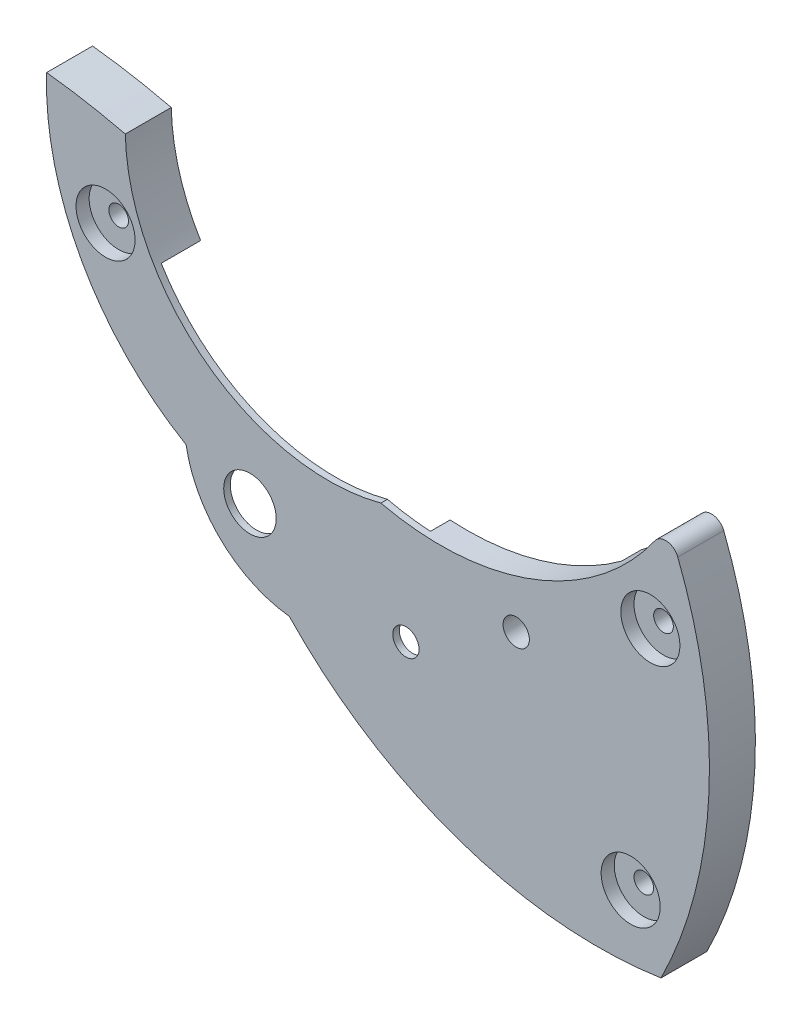
ISO-10303-21;
HEADER;
FILE_DESCRIPTION(('STEP AP214'),'2;1');
FILE_NAME('part.step','',(''),(''),'','','');
FILE_SCHEMA(('AUTOMOTIVE_DESIGN { 1 0 10303 214 1 1 1 1 }'));
ENDSEC;
DATA;
#1=APPLICATION_CONTEXT('core data for automotive mechanical design processes');
#2=APPLICATION_PROTOCOL_DEFINITION('international standard','automotive_design',2000,#1);
#3=PRODUCT_CONTEXT('',#1,'mechanical');
#4=PRODUCT('Part','Part','',(#3));
#5=PRODUCT_RELATED_PRODUCT_CATEGORY('part','',(#4));
#6=PRODUCT_DEFINITION_FORMATION('','',#4);
#7=PRODUCT_DEFINITION_CONTEXT('part definition',#1,'design');
#8=PRODUCT_DEFINITION('design','',#6,#7);
#9=PRODUCT_DEFINITION_SHAPE('','',#8);
#10=(LENGTH_UNIT() NAMED_UNIT(*) SI_UNIT(.MILLI.,.METRE.));
#11=(NAMED_UNIT(*) PLANE_ANGLE_UNIT() SI_UNIT($,.RADIAN.));
#12=(NAMED_UNIT(*) SI_UNIT($,.STERADIAN.) SOLID_ANGLE_UNIT());
#13=UNCERTAINTY_MEASURE_WITH_UNIT(LENGTH_MEASURE(1.E-05),#10,'distance_accuracy_value','');
#14=(GEOMETRIC_REPRESENTATION_CONTEXT(3) GLOBAL_UNCERTAINTY_ASSIGNED_CONTEXT((#13)) GLOBAL_UNIT_ASSIGNED_CONTEXT((#10,
#11,#12)) REPRESENTATION_CONTEXT('',''));
#15=CARTESIAN_POINT('',(0.,0.,0.));
#16=DIRECTION('',(0.,0.,1.));
#17=DIRECTION('',(1.,0.,0.));
#18=AXIS2_PLACEMENT_3D('',#15,#16,#17);
#19=CARTESIAN_POINT('',(5.125,11.125,0.));
#20=DIRECTION('',(0.,0.,1.));
#21=DIRECTION('',(1.,0.,0.));
#22=AXIS2_PLACEMENT_3D('',#19,#20,#21);
#23=PLANE('',#22);
#24=CARTESIAN_POINT('',(-5.5,6.5,0.));
#25=DIRECTION('',(0.,0.,1.));
#26=DIRECTION('',(1.,0.,0.));
#27=AXIS2_PLACEMENT_3D('',#24,#25,#26);
#28=CIRCLE('',#27,0.374999999999999);
#29=CARTESIAN_POINT('',(-5.125,6.5,0.));
#30=VERTEX_POINT('',#29);
#31=EDGE_CURVE('E424',#30,#30,#28,.T.);
#32=ORIENTED_EDGE('',*,*,#31,.T.);
#33=EDGE_LOOP('',(#32));
#34=FACE_BOUND('',#33,.T.);
#35=CARTESIAN_POINT('',(3.,10.,0.));
#36=DIRECTION('',(0.,0.,-1.));
#37=DIRECTION('',(1.,0.,0.));
#38=AXIS2_PLACEMENT_3D('',#35,#36,#37);
#39=CIRCLE('',#38,7.75);
#40=CARTESIAN_POINT('',(-3.62929963297461,5.98566488989238,0.));
#41=VERTEX_POINT('',#40);
#42=CARTESIAN_POINT('',(-4.74779558918888,9.81516626891871,0.));
#43=VERTEX_POINT('',#42);
#44=EDGE_CURVE('E134',#41,#43,#39,.T.);
#45=ORIENTED_EDGE('',*,*,#44,.F.);
#46=CARTESIAN_POINT('',(0.,0.,0.));
#47=DIRECTION('',(0.,0.,-1.));
#48=DIRECTION('',(-1.,0.,0.));
#49=AXIS2_PLACEMENT_3D('',#46,#47,#48);
#50=CIRCLE('',#49,7.);
#51=CARTESIAN_POINT('',(-5.83196120099189,3.8714633602974,0.));
#52=VERTEX_POINT('',#51);
#53=EDGE_CURVE('E296',#52,#41,#50,.T.);
#54=ORIENTED_EDGE('',*,*,#53,.F.);
#55=CARTESIAN_POINT('',(3.,10.,0.));
#56=DIRECTION('',(0.,0.,1.));
#57=DIRECTION('',(1.,0.,0.));
#58=AXIS2_PLACEMENT_3D('',#55,#56,#57);
#59=CIRCLE('',#58,10.7500000000002);
#60=CARTESIAN_POINT('',(-7.74447698150787,10.3445495520981,0.));
#61=VERTEX_POINT('',#60);
#62=EDGE_CURVE('E139',#61,#52,#59,.T.);
#63=ORIENTED_EDGE('',*,*,#62,.F.);
#64=CARTESIAN_POINT('',(-10.5,-14.,0.));
#65=DIRECTION('',(0.,0.,1.));
#66=DIRECTION('',(1.,0.,0.));
#67=AXIS2_PLACEMENT_3D('',#64,#65,#66);
#68=CIRCLE('',#67,24.5);
#69=EDGE_CURVE('E136',#43,#61,#68,.T.);
#70=ORIENTED_EDGE('',*,*,#69,.F.);
#71=EDGE_LOOP('',(#45,#54,#63,#70));
#72=FACE_BOUND('',#71,.T.);
#73=ADVANCED_FACE('F36',(#34,#72),#23,.F.);
#74=CARTESIAN_POINT('',(2.,1.5,1.75));
#75=DIRECTION('',(0.,0.,-1.));
#76=DIRECTION('',(-1.,0.,0.));
#77=AXIS2_PLACEMENT_3D('',#74,#75,#76);
#78=CYLINDRICAL_SURFACE('',#77,4.50000000000022);
#79=CARTESIAN_POINT('',(2.,1.5,1.5));
#80=DIRECTION('',(0.,0.,-1.));
#81=DIRECTION('',(-1.,0.,0.));
#82=AXIS2_PLACEMENT_3D('',#79,#80,#81);
#83=CIRCLE('',#82,4.50000000000022);
#84=CARTESIAN_POINT('',(1.49696633213116,-2.97179573873766,1.5));
#85=VERTEX_POINT('',#84);
#86=CARTESIAN_POINT('',(-2.43253058240849,0.723680068518556,1.5));
#87=VERTEX_POINT('',#86);
#88=EDGE_CURVE('E209',#85,#87,#83,.T.);
#89=ORIENTED_EDGE('',*,*,#88,.F.);
#90=DIRECTION('',(0.,0.,-1.));
#91=VECTOR('',#90,1.);
#92=CARTESIAN_POINT('',(1.49696633213116,-2.97179573873766,1.75));
#93=LINE('',#92,#91);
#94=CARTESIAN_POINT('',(1.49696633213116,-2.97179573873766,1.75));
#95=VERTEX_POINT('',#94);
#96=EDGE_CURVE('E154',#95,#85,#93,.T.);
#97=ORIENTED_EDGE('',*,*,#96,.F.);
#98=CARTESIAN_POINT('',(2.,1.5,1.75));
#99=DIRECTION('',(0.,0.,1.));
#100=DIRECTION('',(1.,0.,0.));
#101=AXIS2_PLACEMENT_3D('',#98,#99,#100);
#102=CIRCLE('',#101,4.50000000000022);
#103=CARTESIAN_POINT('',(-2.43253058240849,0.723680068518556,1.75));
#104=VERTEX_POINT('',#103);
#105=EDGE_CURVE('E199',#104,#95,#102,.T.);
#106=ORIENTED_EDGE('',*,*,#105,.F.);
#107=DIRECTION('',(0.,0.,-1.));
#108=VECTOR('',#107,1.);
#109=CARTESIAN_POINT('',(-2.43253058240849,0.723680068518556,1.75));
#110=LINE('',#109,#108);
#111=EDGE_CURVE('E157',#104,#87,#110,.T.);
#112=ORIENTED_EDGE('',*,*,#111,.T.);
#113=EDGE_LOOP('',(#89,#97,#106,#112));
#114=FACE_BOUND('',#113,.T.);
#115=ADVANCED_FACE('F206',(#114),#78,.T.);
#116=CARTESIAN_POINT('',(0.,0.,1.75));
#117=DIRECTION('',(0.,0.,-1.));
#118=DIRECTION('',(-1.,0.,0.));
#119=AXIS2_PLACEMENT_3D('',#116,#117,#118);
#120=CYLINDRICAL_SURFACE('',#119,0.99999999999998);
#121=CARTESIAN_POINT('',(0.,0.,1.75));
#122=DIRECTION('',(0.,0.,1.));
#123=DIRECTION('',(1.,0.,0.));
#124=AXIS2_PLACEMENT_3D('',#121,#122,#123);
#125=CIRCLE('',#124,0.99999999999998);
#126=CARTESIAN_POINT('',(0.99999999999998,0.,1.75));
#127=VERTEX_POINT('',#126);
#128=EDGE_CURVE('E137',#127,#127,#125,.T.);
#129=ORIENTED_EDGE('',*,*,#128,.T.);
#130=EDGE_LOOP('',(#129));
#131=FACE_BOUND('',#130,.T.);
#132=CARTESIAN_POINT('',(0.,0.,1.5));
#133=DIRECTION('',(0.,0.,-1.));
#134=DIRECTION('',(-1.,0.,0.));
#135=AXIS2_PLACEMENT_3D('',#132,#133,#134);
#136=CIRCLE('',#135,0.99999999999998);
#137=CARTESIAN_POINT('',(-0.99999999999998,0.,1.5));
#138=VERTEX_POINT('',#137);
#139=EDGE_CURVE('E284',#138,#138,#136,.T.);
#140=ORIENTED_EDGE('',*,*,#139,.T.);
#141=EDGE_LOOP('',(#140));
#142=FACE_BOUND('',#141,.T.);
#143=ADVANCED_FACE('F323',(#131,#142),#120,.F.);
#144=CARTESIAN_POINT('',(5.94044383167777,-1.59173712738051,1.75));
#145=DIRECTION('',(0.,0.,-1.));
#146=DIRECTION('',(-1.,0.,0.));
#147=AXIS2_PLACEMENT_3D('',#144,#145,#146);
#148=CYLINDRICAL_SURFACE('',#147,0.499999999999999);
#149=CARTESIAN_POINT('',(5.94044383167777,-1.59173712738051,1.75));
#150=DIRECTION('',(0.,0.,1.));
#151=DIRECTION('',(1.,0.,0.));
#152=AXIS2_PLACEMENT_3D('',#149,#150,#151);
#153=CIRCLE('',#152,0.499999999999999);
#154=CARTESIAN_POINT('',(6.44044383167777,-1.59173712738051,1.75));
#155=VERTEX_POINT('',#154);
#156=EDGE_CURVE('E190',#155,#155,#153,.T.);
#157=ORIENTED_EDGE('',*,*,#156,.T.);
#158=EDGE_LOOP('',(#157));
#159=FACE_BOUND('',#158,.T.);
#160=CARTESIAN_POINT('',(5.94044383167777,-1.59173712738051,1.5));
#161=DIRECTION('',(0.,0.,-1.));
#162=DIRECTION('',(-1.,0.,0.));
#163=AXIS2_PLACEMENT_3D('',#160,#161,#162);
#164=CIRCLE('',#163,0.499999999999999);
#165=CARTESIAN_POINT('',(5.44044383167777,-1.59173712738051,1.5));
#166=VERTEX_POINT('',#165);
#167=EDGE_CURVE('E40',#166,#166,#164,.T.);
#168=ORIENTED_EDGE('',*,*,#167,.T.);
#169=EDGE_LOOP('',(#168));
#170=FACE_BOUND('',#169,.T.);
#171=ADVANCED_FACE('F371',(#159,#170),#148,.F.);
#172=CARTESIAN_POINT('',(10.1406670400323,0.8332628726195,1.75));
#173=DIRECTION('',(0.,0.,-1.));
#174=DIRECTION('',(-1.,0.,0.));
#175=AXIS2_PLACEMENT_3D('',#172,#173,#174);
#176=CYLINDRICAL_SURFACE('',#175,0.499999999999999);
#177=CARTESIAN_POINT('',(10.1406670400323,0.8332628726195,1.75));
#178=DIRECTION('',(0.,0.,1.));
#179=DIRECTION('',(1.,0.,0.));
#180=AXIS2_PLACEMENT_3D('',#177,#178,#179);
#181=CIRCLE('',#180,0.499999999999999);
#182=CARTESIAN_POINT('',(10.6406670400323,0.8332628726195,1.75));
#183=VERTEX_POINT('',#182);
#184=EDGE_CURVE('E187',#183,#183,#181,.T.);
#185=ORIENTED_EDGE('',*,*,#184,.T.);
#186=EDGE_LOOP('',(#185));
#187=FACE_BOUND('',#186,.T.);
#188=CARTESIAN_POINT('',(10.1406670400323,0.8332628726195,0.75));
#189=DIRECTION('',(0.,0.,-1.));
#190=DIRECTION('',(-1.,0.,0.));
#191=AXIS2_PLACEMENT_3D('',#188,#189,#190);
#192=CIRCLE('',#191,0.499999999999999);
#193=CARTESIAN_POINT('',(9.64066704003229,0.8332628726195,0.75));
#194=VERTEX_POINT('',#193);
#195=EDGE_CURVE('E164',#194,#194,#192,.T.);
#196=ORIENTED_EDGE('',*,*,#195,.T.);
#197=EDGE_LOOP('',(#196));
#198=FACE_BOUND('',#197,.T.);
#199=ADVANCED_FACE('F336',(#187,#198),#176,.F.);
#200=CARTESIAN_POINT('',(5.125,11.125,1.75));
#201=DIRECTION('',(0.,0.,1.));
#202=DIRECTION('',(1.,0.,0.));
#203=AXIS2_PLACEMENT_3D('',#200,#201,#202);
#204=PLANE('',#203);
#205=CARTESIAN_POINT('',(14.5,-5.5,1.75));
#206=DIRECTION('',(0.,0.,1.));
#207=DIRECTION('',(1.,0.,0.));
#208=AXIS2_PLACEMENT_3D('',#205,#206,#207);
#209=CIRCLE('',#208,1.125);
#210=CARTESIAN_POINT('',(15.625,-5.5,1.75));
#211=VERTEX_POINT('',#210);
#212=EDGE_CURVE('E346',#211,#211,#209,.T.);
#213=ORIENTED_EDGE('',*,*,#212,.F.);
#214=EDGE_LOOP('',(#213));
#215=FACE_BOUND('',#214,.T.);
#216=CARTESIAN_POINT('',(15.25,3.5,1.75));
#217=DIRECTION('',(0.,0.,1.));
#218=DIRECTION('',(1.,0.,0.));
#219=AXIS2_PLACEMENT_3D('',#216,#217,#218);
#220=CIRCLE('',#219,1.125);
#221=CARTESIAN_POINT('',(16.375,3.5,1.75));
#222=VERTEX_POINT('',#221);
#223=EDGE_CURVE('E357',#222,#222,#220,.T.);
#224=ORIENTED_EDGE('',*,*,#223,.F.);
#225=EDGE_LOOP('',(#224));
#226=FACE_BOUND('',#225,.T.);
#227=CARTESIAN_POINT('',(-5.5,6.5,1.75));
#228=DIRECTION('',(0.,0.,1.));
#229=DIRECTION('',(1.,0.,0.));
#230=AXIS2_PLACEMENT_3D('',#227,#228,#229);
#231=CIRCLE('',#230,1.125);
#232=CARTESIAN_POINT('',(-4.375,6.5,1.75));
#233=VERTEX_POINT('',#232);
#234=EDGE_CURVE('E300',#233,#233,#231,.T.);
#235=ORIENTED_EDGE('',*,*,#234,.F.);
#236=EDGE_LOOP('',(#235));
#237=FACE_BOUND('',#236,.T.);
#238=ORIENTED_EDGE('',*,*,#156,.F.);
#239=EDGE_LOOP('',(#238));
#240=FACE_BOUND('',#239,.T.);
#241=CARTESIAN_POINT('',(3.,10.,1.75));
#242=DIRECTION('',(0.,0.,-1.));
#243=DIRECTION('',(1.,0.,0.));
#244=AXIS2_PLACEMENT_3D('',#241,#242,#243);
#245=CIRCLE('',#244,7.75);
#246=CARTESIAN_POINT('',(4.98775044540647,2.50924915867666,1.75));
#247=VERTEX_POINT('',#246);
#248=CARTESIAN_POINT('',(-4.74779558918888,9.81516626891871,1.75));
#249=VERTEX_POINT('',#248);
#250=EDGE_CURVE('E149',#247,#249,#245,.T.);
#251=ORIENTED_EDGE('',*,*,#250,.T.);
#252=CARTESIAN_POINT('',(-10.5,-14.,1.75));
#253=DIRECTION('',(0.,0.,1.));
#254=DIRECTION('',(1.,0.,0.));
#255=AXIS2_PLACEMENT_3D('',#252,#253,#254);
#256=CIRCLE('',#255,24.5);
#257=CARTESIAN_POINT('',(-7.74447698150787,10.3445495520981,1.75));
#258=VERTEX_POINT('',#257);
#259=EDGE_CURVE('E94',#249,#258,#256,.T.);
#260=ORIENTED_EDGE('',*,*,#259,.T.);
#261=CARTESIAN_POINT('',(3.,10.,1.75));
#262=DIRECTION('',(0.,0.,1.));
#263=DIRECTION('',(1.,0.,0.));
#264=AXIS2_PLACEMENT_3D('',#261,#262,#263);
#265=CIRCLE('',#264,10.7500000000002);
#266=EDGE_CURVE('E197',#258,#104,#265,.T.);
#267=ORIENTED_EDGE('',*,*,#266,.T.);
#268=ORIENTED_EDGE('',*,*,#105,.T.);
#269=CARTESIAN_POINT('',(13.25,8.25,1.75));
#270=DIRECTION('',(0.,0.,1.));
#271=DIRECTION('',(1.,0.,0.));
#272=AXIS2_PLACEMENT_3D('',#269,#270,#271);
#273=CIRCLE('',#272,16.2500000000003);
#274=CARTESIAN_POINT('',(15.6550771901216,-7.82103306292306,1.75));
#275=VERTEX_POINT('',#274);
#276=EDGE_CURVE('E116',#95,#275,#273,.T.);
#277=ORIENTED_EDGE('',*,*,#276,.T.);
#278=CARTESIAN_POINT('',(0.,0.,1.75));
#279=DIRECTION('',(0.,0.,1.));
#280=DIRECTION('',(1.,0.,0.));
#281=AXIS2_PLACEMENT_3D('',#278,#279,#280);
#282=CIRCLE('',#281,17.5);
#283=CARTESIAN_POINT('',(16.2956500802893,6.37979533063312,1.75));
#284=VERTEX_POINT('',#283);
#285=EDGE_CURVE('E109',#275,#284,#282,.T.);
#286=ORIENTED_EDGE('',*,*,#285,.T.);
#287=CARTESIAN_POINT('',(15.8300600779953,6.1975154640436,1.75));
#288=DIRECTION('',(0.,0.,1.));
#289=DIRECTION('',(1.,0.,0.));
#290=AXIS2_PLACEMENT_3D('',#287,#288,#289);
#291=CIRCLE('',#290,0.5);
#292=CARTESIAN_POINT('',(15.4214857885669,6.48572901337485,1.75));
#293=VERTEX_POINT('',#292);
#294=EDGE_CURVE('E114',#284,#293,#291,.T.);
#295=ORIENTED_EDGE('',*,*,#294,.T.);
#296=CARTESIAN_POINT('',(7.25,12.25,1.75));
#297=DIRECTION('',(0.,0.,-1.));
#298=DIRECTION('',(1.,0.,0.));
#299=AXIS2_PLACEMENT_3D('',#296,#297,#298);
#300=CIRCLE('',#299,10.);
#301=EDGE_CURVE('E60',#293,#247,#300,.T.);
#302=ORIENTED_EDGE('',*,*,#301,.T.);
#303=EDGE_LOOP('',(#251,#260,#267,#268,#277,#286,#295,#302));
#304=FACE_BOUND('',#303,.T.);
#305=ORIENTED_EDGE('',*,*,#128,.F.);
#306=EDGE_LOOP('',(#305));
#307=FACE_BOUND('',#306,.T.);
#308=ORIENTED_EDGE('',*,*,#184,.F.);
#309=EDGE_LOOP('',(#308));
#310=FACE_BOUND('',#309,.T.);
#311=ADVANCED_FACE('F111',(#215,#226,#237,#240,#304,#307,#310),#204,.T.);
#312=CARTESIAN_POINT('',(14.5,-5.5,0.));
#313=DIRECTION('',(0.,0.,1.));
#314=DIRECTION('',(1.,0.,0.));
#315=AXIS2_PLACEMENT_3D('',#312,#313,#314);
#316=CIRCLE('',#315,0.375);
#317=CARTESIAN_POINT('',(14.875,-5.5,0.));
#318=VERTEX_POINT('',#317);
#319=EDGE_CURVE('E341',#318,#318,#316,.T.);
#320=ORIENTED_EDGE('',*,*,#319,.T.);
#321=EDGE_LOOP('',(#320));
#322=FACE_BOUND('',#321,.T.);
#323=CARTESIAN_POINT('',(15.25,3.5,0.));
#324=DIRECTION('',(0.,0.,1.));
#325=DIRECTION('',(1.,0.,0.));
#326=AXIS2_PLACEMENT_3D('',#323,#324,#325);
#327=CIRCLE('',#326,0.375);
#328=CARTESIAN_POINT('',(15.625,3.5,0.));
#329=VERTEX_POINT('',#328);
#330=EDGE_CURVE('E344',#329,#329,#327,.T.);
#331=ORIENTED_EDGE('',*,*,#330,.T.);
#332=EDGE_LOOP('',(#331));
#333=FACE_BOUND('',#332,.T.);
#334=CARTESIAN_POINT('',(13.25,8.25,0.));
#335=DIRECTION('',(0.,0.,1.));
#336=DIRECTION('',(1.,0.,0.));
#337=AXIS2_PLACEMENT_3D('',#334,#335,#336);
#338=CIRCLE('',#337,16.2500000000003);
#339=CARTESIAN_POINT('',(4.44487898154678,-5.40768442490903,0.));
#340=VERTEX_POINT('',#339);
#341=CARTESIAN_POINT('',(15.6550771901216,-7.82103306292306,0.));
#342=VERTEX_POINT('',#341);
#343=EDGE_CURVE('E142',#340,#342,#338,.T.);
#344=ORIENTED_EDGE('',*,*,#343,.F.);
#345=CARTESIAN_POINT('',(6.69110879720328,-2.05646859056707,0.));
#346=VERTEX_POINT('',#345);
#347=EDGE_CURVE('E294',#346,#340,#50,.T.);
#348=ORIENTED_EDGE('',*,*,#347,.F.);
#349=CARTESIAN_POINT('',(10.1406670400323,0.8332628726195,0.));
#350=DIRECTION('',(0.,0.,-1.));
#351=DIRECTION('',(-1.,0.,0.));
#352=AXIS2_PLACEMENT_3D('',#349,#350,#351);
#353=CIRCLE('',#352,4.5);
#354=CARTESIAN_POINT('',(13.1518555762726,4.17732381692288,0.));
#355=VERTEX_POINT('',#354);
#356=EDGE_CURVE('E174',#355,#346,#353,.T.);
#357=ORIENTED_EDGE('',*,*,#356,.F.);
#358=CARTESIAN_POINT('',(7.25,12.25,0.));
#359=DIRECTION('',(0.,0.,-1.));
#360=DIRECTION('',(1.,0.,0.));
#361=AXIS2_PLACEMENT_3D('',#358,#359,#360);
#362=CIRCLE('',#361,10.);
#363=CARTESIAN_POINT('',(15.4214857885669,6.48572901337485,0.));
#364=VERTEX_POINT('',#363);
#365=EDGE_CURVE('E146',#364,#355,#362,.T.);
#366=ORIENTED_EDGE('',*,*,#365,.F.);
#367=CARTESIAN_POINT('',(15.8300600779953,6.1975154640436,0.));
#368=DIRECTION('',(0.,0.,1.));
#369=DIRECTION('',(1.,0.,0.));
#370=AXIS2_PLACEMENT_3D('',#367,#368,#369);
#371=CIRCLE('',#370,0.5);
#372=CARTESIAN_POINT('',(16.2956500802893,6.37979533063312,0.));
#373=VERTEX_POINT('',#372);
#374=EDGE_CURVE('E85',#373,#364,#371,.T.);
#375=ORIENTED_EDGE('',*,*,#374,.F.);
#376=CARTESIAN_POINT('',(0.,0.,0.));
#377=DIRECTION('',(0.,0.,1.));
#378=DIRECTION('',(1.,0.,0.));
#379=AXIS2_PLACEMENT_3D('',#376,#377,#378);
#380=CIRCLE('',#379,17.5);
#381=EDGE_CURVE('E124',#342,#373,#380,.T.);
#382=ORIENTED_EDGE('',*,*,#381,.F.);
#383=EDGE_LOOP('',(#344,#348,#357,#366,#375,#382));
#384=FACE_BOUND('',#383,.T.);
#385=ADVANCED_FACE('F216',(#322,#333,#384),#23,.F.);
#386=CARTESIAN_POINT('',(3.,10.,1.75));
#387=DIRECTION('',(0.,0.,-1.));
#388=DIRECTION('',(-1.,0.,0.));
#389=AXIS2_PLACEMENT_3D('',#386,#387,#388);
#390=CYLINDRICAL_SURFACE('',#389,7.75);
#391=CARTESIAN_POINT('',(3.,10.,1.5));
#392=DIRECTION('',(0.,0.,-1.));
#393=DIRECTION('',(-1.,0.,0.));
#394=AXIS2_PLACEMENT_3D('',#391,#392,#393);
#395=CIRCLE('',#394,7.75);
#396=CARTESIAN_POINT('',(-3.62929963297461,5.98566488989238,1.5));
#397=VERTEX_POINT('',#396);
#398=CARTESIAN_POINT('',(4.98775044540647,2.50924915867666,1.5));
#399=VERTEX_POINT('',#398);
#400=EDGE_CURVE('E289',#397,#399,#395,.F.);
#401=ORIENTED_EDGE('',*,*,#400,.F.);
#402=DIRECTION('',(0.,0.,-1.));
#403=VECTOR('',#402,1.);
#404=CARTESIAN_POINT('',(-3.62929963297461,5.98566488989238,0.75));
#405=LINE('',#404,#403);
#406=EDGE_CURVE('E272',#397,#41,#405,.T.);
#407=ORIENTED_EDGE('',*,*,#406,.T.);
#408=ORIENTED_EDGE('',*,*,#44,.T.);
#409=DIRECTION('',(0.,0.,-1.));
#410=VECTOR('',#409,1.);
#411=CARTESIAN_POINT('',(-4.74779558918888,9.81516626891871,1.75));
#412=LINE('',#411,#410);
#413=EDGE_CURVE('E45',#249,#43,#412,.T.);
#414=ORIENTED_EDGE('',*,*,#413,.F.);
#415=ORIENTED_EDGE('',*,*,#250,.F.);
#416=DIRECTION('',(0.,0.,-1.));
#417=VECTOR('',#416,1.);
#418=CARTESIAN_POINT('',(4.98775044540647,2.50924915867666,1.75));
#419=LINE('',#418,#417);
#420=EDGE_CURVE('E130',#247,#399,#419,.T.);
#421=ORIENTED_EDGE('',*,*,#420,.T.);
#422=EDGE_LOOP('',(#401,#407,#408,#414,#415,#421));
#423=FACE_BOUND('',#422,.T.);
#424=ADVANCED_FACE('F38',(#423),#390,.F.);
#425=CARTESIAN_POINT('',(-10.5,-14.,1.75));
#426=DIRECTION('',(0.,0.,-1.));
#427=DIRECTION('',(-1.,0.,0.));
#428=AXIS2_PLACEMENT_3D('',#425,#426,#427);
#429=CYLINDRICAL_SURFACE('',#428,24.5);
#430=ORIENTED_EDGE('',*,*,#69,.T.);
#431=DIRECTION('',(0.,0.,-1.));
#432=VECTOR('',#431,1.);
#433=CARTESIAN_POINT('',(-7.74447698150787,10.3445495520981,1.75));
#434=LINE('',#433,#432);
#435=EDGE_CURVE('E160',#258,#61,#434,.T.);
#436=ORIENTED_EDGE('',*,*,#435,.F.);
#437=ORIENTED_EDGE('',*,*,#259,.F.);
#438=ORIENTED_EDGE('',*,*,#413,.T.);
#439=EDGE_LOOP('',(#430,#436,#437,#438));
#440=FACE_BOUND('',#439,.T.);
#441=ADVANCED_FACE('F334',(#440),#429,.T.);
#442=CARTESIAN_POINT('',(3.,10.,1.75));
#443=DIRECTION('',(0.,0.,-1.));
#444=DIRECTION('',(-1.,0.,0.));
#445=AXIS2_PLACEMENT_3D('',#442,#443,#444);
#446=CYLINDRICAL_SURFACE('',#445,10.7500000000002);
#447=ORIENTED_EDGE('',*,*,#62,.T.);
#448=DIRECTION('',(0.,0.,-1.));
#449=VECTOR('',#448,1.);
#450=CARTESIAN_POINT('',(-5.83196120099189,3.8714633602974,0.75));
#451=LINE('',#450,#449);
#452=CARTESIAN_POINT('',(-5.83196120099189,3.8714633602974,1.5));
#453=VERTEX_POINT('',#452);
#454=EDGE_CURVE('E269',#52,#453,#451,.F.);
#455=ORIENTED_EDGE('',*,*,#454,.T.);
#456=CARTESIAN_POINT('',(3.,10.,1.5));
#457=DIRECTION('',(0.,0.,-1.));
#458=DIRECTION('',(-1.,0.,0.));
#459=AXIS2_PLACEMENT_3D('',#456,#457,#458);
#460=CIRCLE('',#459,10.7500000000002);
#461=EDGE_CURVE('E180',#87,#453,#460,.T.);
#462=ORIENTED_EDGE('',*,*,#461,.F.);
#463=ORIENTED_EDGE('',*,*,#111,.F.);
#464=ORIENTED_EDGE('',*,*,#266,.F.);
#465=ORIENTED_EDGE('',*,*,#435,.T.);
#466=EDGE_LOOP('',(#447,#455,#462,#463,#464,#465));
#467=FACE_BOUND('',#466,.T.);
#468=ADVANCED_FACE('F276',(#467),#446,.T.);
#469=CARTESIAN_POINT('',(13.25,8.25,1.75));
#470=DIRECTION('',(0.,0.,-1.));
#471=DIRECTION('',(-1.,0.,0.));
#472=AXIS2_PLACEMENT_3D('',#469,#470,#471);
#473=CYLINDRICAL_SURFACE('',#472,16.2500000000003);
#474=CARTESIAN_POINT('',(13.25,8.25,1.5));
#475=DIRECTION('',(0.,0.,-1.));
#476=DIRECTION('',(-1.,0.,0.));
#477=AXIS2_PLACEMENT_3D('',#474,#475,#476);
#478=CIRCLE('',#477,16.2500000000003);
#479=CARTESIAN_POINT('',(4.44487898154678,-5.40768442490903,1.5));
#480=VERTEX_POINT('',#479);
#481=EDGE_CURVE('E291',#480,#85,#478,.T.);
#482=ORIENTED_EDGE('',*,*,#481,.F.);
#483=DIRECTION('',(0.,0.,-1.));
#484=VECTOR('',#483,1.);
#485=CARTESIAN_POINT('',(4.44487898154678,-5.40768442490903,0.75));
#486=LINE('',#485,#484);
#487=EDGE_CURVE('E278',#480,#340,#486,.T.);
#488=ORIENTED_EDGE('',*,*,#487,.T.);
#489=ORIENTED_EDGE('',*,*,#343,.T.);
#490=DIRECTION('',(0.,0.,-1.));
#491=VECTOR('',#490,1.);
#492=CARTESIAN_POINT('',(15.6550771901216,-7.82103306292306,1.75));
#493=LINE('',#492,#491);
#494=EDGE_CURVE('E125',#275,#342,#493,.T.);
#495=ORIENTED_EDGE('',*,*,#494,.F.);
#496=ORIENTED_EDGE('',*,*,#276,.F.);
#497=ORIENTED_EDGE('',*,*,#96,.T.);
#498=EDGE_LOOP('',(#482,#488,#489,#495,#496,#497));
#499=FACE_BOUND('',#498,.T.);
#500=ADVANCED_FACE('F212',(#499),#473,.T.);
#501=CARTESIAN_POINT('',(0.,0.,1.75));
#502=DIRECTION('',(0.,0.,-1.));
#503=DIRECTION('',(-1.,0.,0.));
#504=AXIS2_PLACEMENT_3D('',#501,#502,#503);
#505=CYLINDRICAL_SURFACE('',#504,17.5);
#506=ORIENTED_EDGE('',*,*,#381,.T.);
#507=DIRECTION('',(0.,0.,-1.));
#508=VECTOR('',#507,1.);
#509=CARTESIAN_POINT('',(16.2956500802893,6.37979533063312,1.75));
#510=LINE('',#509,#508);
#511=EDGE_CURVE('E121',#284,#373,#510,.T.);
#512=ORIENTED_EDGE('',*,*,#511,.F.);
#513=ORIENTED_EDGE('',*,*,#285,.F.);
#514=ORIENTED_EDGE('',*,*,#494,.T.);
#515=EDGE_LOOP('',(#506,#512,#513,#514));
#516=FACE_BOUND('',#515,.T.);
#517=ADVANCED_FACE('F122',(#516),#505,.T.);
#518=CARTESIAN_POINT('',(15.8300600779953,6.1975154640436,1.75));
#519=DIRECTION('',(0.,0.,-1.));
#520=DIRECTION('',(-1.,0.,0.));
#521=AXIS2_PLACEMENT_3D('',#518,#519,#520);
#522=CYLINDRICAL_SURFACE('',#521,0.5);
#523=ORIENTED_EDGE('',*,*,#374,.T.);
#524=DIRECTION('',(0.,0.,-1.));
#525=VECTOR('',#524,1.);
#526=CARTESIAN_POINT('',(15.4214857885669,6.48572901337485,1.75));
#527=LINE('',#526,#525);
#528=EDGE_CURVE('E126',#293,#364,#527,.T.);
#529=ORIENTED_EDGE('',*,*,#528,.F.);
#530=ORIENTED_EDGE('',*,*,#294,.F.);
#531=ORIENTED_EDGE('',*,*,#511,.T.);
#532=EDGE_LOOP('',(#523,#529,#530,#531));
#533=FACE_BOUND('',#532,.T.);
#534=ADVANCED_FACE('F128',(#533),#522,.T.);
#535=CARTESIAN_POINT('',(7.25,12.25,1.75));
#536=DIRECTION('',(0.,0.,-1.));
#537=DIRECTION('',(-1.,0.,0.));
#538=AXIS2_PLACEMENT_3D('',#535,#536,#537);
#539=CYLINDRICAL_SURFACE('',#538,10.);
#540=CARTESIAN_POINT('',(7.25,12.25,0.75));
#541=DIRECTION('',(0.,0.,-1.));
#542=DIRECTION('',(-1.,0.,0.));
#543=AXIS2_PLACEMENT_3D('',#540,#541,#542);
#544=CIRCLE('',#543,10.);
#545=CARTESIAN_POINT('',(6.6217995325694,2.26975129705076,0.75));
#546=VERTEX_POINT('',#545);
#547=CARTESIAN_POINT('',(13.1518555762726,4.17732381692288,0.75));
#548=VERTEX_POINT('',#547);
#549=EDGE_CURVE('E166',#546,#548,#544,.F.);
#550=ORIENTED_EDGE('',*,*,#549,.F.);
#551=DIRECTION('',(0.,0.,-1.));
#552=VECTOR('',#551,1.);
#553=CARTESIAN_POINT('',(6.6217995325694,2.26975129705076,0.75));
#554=LINE('',#553,#552);
#555=CARTESIAN_POINT('',(6.6217995325694,2.26975129705076,1.5));
#556=VERTEX_POINT('',#555);
#557=EDGE_CURVE('E51',#546,#556,#554,.F.);
#558=ORIENTED_EDGE('',*,*,#557,.T.);
#559=CARTESIAN_POINT('',(7.25,12.25,1.5));
#560=DIRECTION('',(0.,0.,-1.));
#561=DIRECTION('',(-1.,0.,0.));
#562=AXIS2_PLACEMENT_3D('',#559,#560,#561);
#563=CIRCLE('',#562,10.);
#564=EDGE_CURVE('E287',#399,#556,#563,.F.);
#565=ORIENTED_EDGE('',*,*,#564,.F.);
#566=ORIENTED_EDGE('',*,*,#420,.F.);
#567=ORIENTED_EDGE('',*,*,#301,.F.);
#568=ORIENTED_EDGE('',*,*,#528,.T.);
#569=ORIENTED_EDGE('',*,*,#365,.T.);
#570=DIRECTION('',(0.,0.,-1.));
#571=VECTOR('',#570,1.);
#572=CARTESIAN_POINT('',(13.1518555762726,4.17732381692288,0.375));
#573=LINE('',#572,#571);
#574=EDGE_CURVE('E171',#355,#548,#573,.F.);
#575=ORIENTED_EDGE('',*,*,#574,.T.);
#576=EDGE_LOOP('',(#550,#558,#565,#566,#567,#568,#569,#575));
#577=FACE_BOUND('',#576,.T.);
#578=ADVANCED_FACE('F224',(#577),#539,.F.);
#579=CARTESIAN_POINT('',(10.1406670400323,0.8332628726195,0.75));
#580=DIRECTION('',(0.,0.,-1.));
#581=DIRECTION('',(-1.,0.,0.));
#582=AXIS2_PLACEMENT_3D('',#579,#580,#581);
#583=CYLINDRICAL_SURFACE('',#582,4.5);
#584=ORIENTED_EDGE('',*,*,#356,.T.);
#585=DIRECTION('',(0.,0.,-1.));
#586=VECTOR('',#585,1.);
#587=CARTESIAN_POINT('',(6.69110879720328,-2.05646859056707,0.75));
#588=LINE('',#587,#586);
#589=CARTESIAN_POINT('',(6.69110879720328,-2.05646859056707,0.75));
#590=VERTEX_POINT('',#589);
#591=EDGE_CURVE('E273',#346,#590,#588,.F.);
#592=ORIENTED_EDGE('',*,*,#591,.T.);
#593=CARTESIAN_POINT('',(10.1406670400323,0.8332628726195,0.75));
#594=DIRECTION('',(0.,0.,-1.));
#595=DIRECTION('',(-1.,0.,0.));
#596=AXIS2_PLACEMENT_3D('',#593,#594,#595);
#597=CIRCLE('',#596,4.5);
#598=EDGE_CURVE('E167',#548,#590,#597,.T.);
#599=ORIENTED_EDGE('',*,*,#598,.F.);
#600=ORIENTED_EDGE('',*,*,#574,.F.);
#601=EDGE_LOOP('',(#584,#592,#599,#600));
#602=FACE_BOUND('',#601,.T.);
#603=ADVANCED_FACE('F307',(#602),#583,.F.);
#604=CARTESIAN_POINT('',(10.1406670400323,0.8332628726195,0.75));
#605=DIRECTION('',(0.,0.,-1.));
#606=DIRECTION('',(-1.,0.,0.));
#607=AXIS2_PLACEMENT_3D('',#604,#605,#606);
#608=PLANE('',#607);
#609=CARTESIAN_POINT('',(0.,0.,0.75));
#610=DIRECTION('',(0.,0.,-1.));
#611=DIRECTION('',(-1.,0.,0.));
#612=AXIS2_PLACEMENT_3D('',#609,#610,#611);
#613=CIRCLE('',#612,7.);
#614=EDGE_CURVE('E11',#546,#590,#613,.T.);
#615=ORIENTED_EDGE('',*,*,#614,.F.);
#616=ORIENTED_EDGE('',*,*,#549,.T.);
#617=ORIENTED_EDGE('',*,*,#598,.T.);
#618=EDGE_LOOP('',(#615,#616,#617));
#619=FACE_BOUND('',#618,.T.);
#620=ORIENTED_EDGE('',*,*,#195,.F.);
#621=EDGE_LOOP('',(#620));
#622=FACE_BOUND('',#621,.T.);
#623=ADVANCED_FACE('F305',(#619,#622),#608,.T.);
#624=CARTESIAN_POINT('',(0.,0.,1.5));
#625=DIRECTION('',(0.,0.,-1.));
#626=DIRECTION('',(-1.,0.,0.));
#627=AXIS2_PLACEMENT_3D('',#624,#625,#626);
#628=PLANE('',#627);
#629=ORIENTED_EDGE('',*,*,#139,.F.);
#630=EDGE_LOOP('',(#629));
#631=FACE_BOUND('',#630,.T.);
#632=ORIENTED_EDGE('',*,*,#167,.F.);
#633=EDGE_LOOP('',(#632));
#634=FACE_BOUND('',#633,.T.);
#635=ORIENTED_EDGE('',*,*,#461,.T.);
#636=CARTESIAN_POINT('',(0.,0.,1.5));
#637=DIRECTION('',(0.,0.,-1.));
#638=DIRECTION('',(-1.,0.,0.));
#639=AXIS2_PLACEMENT_3D('',#636,#637,#638);
#640=CIRCLE('',#639,7.);
#641=EDGE_CURVE('E263',#453,#397,#640,.T.);
#642=ORIENTED_EDGE('',*,*,#641,.T.);
#643=ORIENTED_EDGE('',*,*,#400,.T.);
#644=ORIENTED_EDGE('',*,*,#564,.T.);
#645=EDGE_CURVE('E274',#556,#480,#640,.T.);
#646=ORIENTED_EDGE('',*,*,#645,.T.);
#647=ORIENTED_EDGE('',*,*,#481,.T.);
#648=ORIENTED_EDGE('',*,*,#88,.T.);
#649=EDGE_LOOP('',(#635,#642,#643,#644,#646,#647,#648));
#650=FACE_BOUND('',#649,.T.);
#651=ADVANCED_FACE('F262',(#631,#634,#650),#628,.T.);
#652=CARTESIAN_POINT('',(0.,0.,1.5));
#653=DIRECTION('',(0.,0.,-1.));
#654=DIRECTION('',(-1.,0.,0.));
#655=AXIS2_PLACEMENT_3D('',#652,#653,#654);
#656=CYLINDRICAL_SURFACE('',#655,7.);
#657=ORIENTED_EDGE('',*,*,#641,.F.);
#658=ORIENTED_EDGE('',*,*,#454,.F.);
#659=ORIENTED_EDGE('',*,*,#53,.T.);
#660=ORIENTED_EDGE('',*,*,#406,.F.);
#661=EDGE_LOOP('',(#657,#658,#659,#660));
#662=FACE_BOUND('',#661,.T.);
#663=ADVANCED_FACE('F268',(#662),#656,.F.);
#664=ORIENTED_EDGE('',*,*,#645,.F.);
#665=ORIENTED_EDGE('',*,*,#557,.F.);
#666=ORIENTED_EDGE('',*,*,#614,.T.);
#667=ORIENTED_EDGE('',*,*,#591,.F.);
#668=ORIENTED_EDGE('',*,*,#347,.T.);
#669=ORIENTED_EDGE('',*,*,#487,.F.);
#670=EDGE_LOOP('',(#664,#665,#666,#667,#668,#669));
#671=FACE_BOUND('',#670,.T.);
#672=ADVANCED_FACE('F293',(#671),#656,.F.);
#673=CARTESIAN_POINT('',(-5.5,6.5,1.25));
#674=DIRECTION('',(0.,0.,1.));
#675=DIRECTION('',(1.,0.,0.));
#676=AXIS2_PLACEMENT_3D('',#673,#674,#675);
#677=CYLINDRICAL_SURFACE('',#676,1.125);
#678=CARTESIAN_POINT('',(-5.5,6.5,1.25));
#679=DIRECTION('',(0.,0.,1.));
#680=DIRECTION('',(1.,0.,0.));
#681=AXIS2_PLACEMENT_3D('',#678,#679,#680);
#682=CIRCLE('',#681,1.125);
#683=CARTESIAN_POINT('',(-4.375,6.5,1.25));
#684=VERTEX_POINT('',#683);
#685=EDGE_CURVE('E297',#684,#684,#682,.T.);
#686=ORIENTED_EDGE('',*,*,#685,.F.);
#687=EDGE_LOOP('',(#686));
#688=FACE_BOUND('',#687,.T.);
#689=ORIENTED_EDGE('',*,*,#234,.T.);
#690=EDGE_LOOP('',(#689));
#691=FACE_BOUND('',#690,.T.);
#692=ADVANCED_FACE('F366',(#688,#691),#677,.F.);
#693=CARTESIAN_POINT('',(-5.5,6.5,1.25));
#694=DIRECTION('',(0.,0.,1.));
#695=DIRECTION('',(1.,0.,0.));
#696=AXIS2_PLACEMENT_3D('',#693,#694,#695);
#697=PLANE('',#696);
#698=CARTESIAN_POINT('',(-5.5,6.5,1.25));
#699=DIRECTION('',(0.,0.,1.));
#700=DIRECTION('',(1.,0.,0.));
#701=AXIS2_PLACEMENT_3D('',#698,#699,#700);
#702=CIRCLE('',#701,0.374999999999999);
#703=CARTESIAN_POINT('',(-5.125,6.5,1.25));
#704=VERTEX_POINT('',#703);
#705=EDGE_CURVE('E427',#704,#704,#702,.T.);
#706=ORIENTED_EDGE('',*,*,#705,.F.);
#707=EDGE_LOOP('',(#706));
#708=FACE_BOUND('',#707,.T.);
#709=ORIENTED_EDGE('',*,*,#685,.T.);
#710=EDGE_LOOP('',(#709));
#711=FACE_BOUND('',#710,.T.);
#712=ADVANCED_FACE('F389',(#708,#711),#697,.T.);
#713=CARTESIAN_POINT('',(15.25,3.5,1.25));
#714=DIRECTION('',(0.,0.,1.));
#715=DIRECTION('',(1.,0.,0.));
#716=AXIS2_PLACEMENT_3D('',#713,#714,#715);
#717=CYLINDRICAL_SURFACE('',#716,1.125);
#718=CARTESIAN_POINT('',(15.25,3.5,1.25));
#719=DIRECTION('',(0.,0.,1.));
#720=DIRECTION('',(1.,0.,0.));
#721=AXIS2_PLACEMENT_3D('',#718,#719,#720);
#722=CIRCLE('',#721,1.125);
#723=CARTESIAN_POINT('',(16.375,3.5,1.25));
#724=VERTEX_POINT('',#723);
#725=EDGE_CURVE('E359',#724,#724,#722,.T.);
#726=ORIENTED_EDGE('',*,*,#725,.F.);
#727=EDGE_LOOP('',(#726));
#728=FACE_BOUND('',#727,.T.);
#729=ORIENTED_EDGE('',*,*,#223,.T.);
#730=EDGE_LOOP('',(#729));
#731=FACE_BOUND('',#730,.T.);
#732=ADVANCED_FACE('F393',(#728,#731),#717,.F.);
#733=CARTESIAN_POINT('',(15.25,3.5,1.25));
#734=DIRECTION('',(0.,0.,1.));
#735=DIRECTION('',(1.,0.,0.));
#736=AXIS2_PLACEMENT_3D('',#733,#734,#735);
#737=PLANE('',#736);
#738=CARTESIAN_POINT('',(15.25,3.5,1.25));
#739=DIRECTION('',(0.,0.,1.));
#740=DIRECTION('',(1.,0.,0.));
#741=AXIS2_PLACEMENT_3D('',#738,#739,#740);
#742=CIRCLE('',#741,0.375);
#743=CARTESIAN_POINT('',(15.625,3.5,1.25));
#744=VERTEX_POINT('',#743);
#745=EDGE_CURVE('E347',#744,#744,#742,.T.);
#746=ORIENTED_EDGE('',*,*,#745,.F.);
#747=EDGE_LOOP('',(#746));
#748=FACE_BOUND('',#747,.T.);
#749=ORIENTED_EDGE('',*,*,#725,.T.);
#750=EDGE_LOOP('',(#749));
#751=FACE_BOUND('',#750,.T.);
#752=ADVANCED_FACE('F397',(#748,#751),#737,.T.);
#753=CARTESIAN_POINT('',(14.5,-5.5,1.25));
#754=DIRECTION('',(0.,0.,1.));
#755=DIRECTION('',(1.,0.,0.));
#756=AXIS2_PLACEMENT_3D('',#753,#754,#755);
#757=CYLINDRICAL_SURFACE('',#756,1.125);
#758=CARTESIAN_POINT('',(14.5,-5.5,1.25));
#759=DIRECTION('',(0.,0.,1.));
#760=DIRECTION('',(1.,0.,0.));
#761=AXIS2_PLACEMENT_3D('',#758,#759,#760);
#762=CIRCLE('',#761,1.125);
#763=CARTESIAN_POINT('',(15.625,-5.5,1.25));
#764=VERTEX_POINT('',#763);
#765=EDGE_CURVE('E350',#764,#764,#762,.T.);
#766=ORIENTED_EDGE('',*,*,#765,.F.);
#767=EDGE_LOOP('',(#766));
#768=FACE_BOUND('',#767,.T.);
#769=ORIENTED_EDGE('',*,*,#212,.T.);
#770=EDGE_LOOP('',(#769));
#771=FACE_BOUND('',#770,.T.);
#772=ADVANCED_FACE('F401',(#768,#771),#757,.F.);
#773=CARTESIAN_POINT('',(14.5,-5.5,1.25));
#774=DIRECTION('',(0.,0.,1.));
#775=DIRECTION('',(1.,0.,0.));
#776=AXIS2_PLACEMENT_3D('',#773,#774,#775);
#777=PLANE('',#776);
#778=CARTESIAN_POINT('',(14.5,-5.5,1.25));
#779=DIRECTION('',(0.,0.,1.));
#780=DIRECTION('',(1.,0.,0.));
#781=AXIS2_PLACEMENT_3D('',#778,#779,#780);
#782=CIRCLE('',#781,0.375);
#783=CARTESIAN_POINT('',(14.875,-5.5,1.25));
#784=VERTEX_POINT('',#783);
#785=EDGE_CURVE('E429',#784,#784,#782,.T.);
#786=ORIENTED_EDGE('',*,*,#785,.F.);
#787=EDGE_LOOP('',(#786));
#788=FACE_BOUND('',#787,.T.);
#789=ORIENTED_EDGE('',*,*,#765,.T.);
#790=EDGE_LOOP('',(#789));
#791=FACE_BOUND('',#790,.T.);
#792=ADVANCED_FACE('F405',(#788,#791),#777,.T.);
#793=CARTESIAN_POINT('',(15.25,3.5,1.25));
#794=DIRECTION('',(0.,0.,1.));
#795=DIRECTION('',(1.,0.,0.));
#796=AXIS2_PLACEMENT_3D('',#793,#794,#795);
#797=CYLINDRICAL_SURFACE('',#796,0.375);
#798=ORIENTED_EDGE('',*,*,#330,.F.);
#799=EDGE_LOOP('',(#798));
#800=FACE_BOUND('',#799,.T.);
#801=ORIENTED_EDGE('',*,*,#745,.T.);
#802=EDGE_LOOP('',(#801));
#803=FACE_BOUND('',#802,.T.);
#804=ADVANCED_FACE('F409',(#800,#803),#797,.F.);
#805=CARTESIAN_POINT('',(14.5,-5.5,1.25));
#806=DIRECTION('',(0.,0.,1.));
#807=DIRECTION('',(1.,0.,0.));
#808=AXIS2_PLACEMENT_3D('',#805,#806,#807);
#809=CYLINDRICAL_SURFACE('',#808,0.375);
#810=ORIENTED_EDGE('',*,*,#319,.F.);
#811=EDGE_LOOP('',(#810));
#812=FACE_BOUND('',#811,.T.);
#813=ORIENTED_EDGE('',*,*,#785,.T.);
#814=EDGE_LOOP('',(#813));
#815=FACE_BOUND('',#814,.T.);
#816=ADVANCED_FACE('F413',(#812,#815),#809,.F.);
#817=CARTESIAN_POINT('',(-5.5,6.5,1.25));
#818=DIRECTION('',(0.,0.,1.));
#819=DIRECTION('',(1.,0.,0.));
#820=AXIS2_PLACEMENT_3D('',#817,#818,#819);
#821=CYLINDRICAL_SURFACE('',#820,0.374999999999999);
#822=ORIENTED_EDGE('',*,*,#31,.F.);
#823=EDGE_LOOP('',(#822));
#824=FACE_BOUND('',#823,.T.);
#825=ORIENTED_EDGE('',*,*,#705,.T.);
#826=EDGE_LOOP('',(#825));
#827=FACE_BOUND('',#826,.T.);
#828=ADVANCED_FACE('F416',(#824,#827),#821,.F.);
#829=CLOSED_SHELL('',(#73,#115,#143,#171,#199,#311,#385,#424,#441,#468,#500,#517,#534,#578,#603,
#623,#651,#663,#672,#692,#712,#732,#752,#772,#792,#804,#816,#828));
#830=MANIFOLD_SOLID_BREP('B2',#829);
#831=ADVANCED_BREP_SHAPE_REPRESENTATION('',(#18,#830),#14);
#832=SHAPE_DEFINITION_REPRESENTATION(#9,#831);
ENDSEC;
END-ISO-10303-21;
